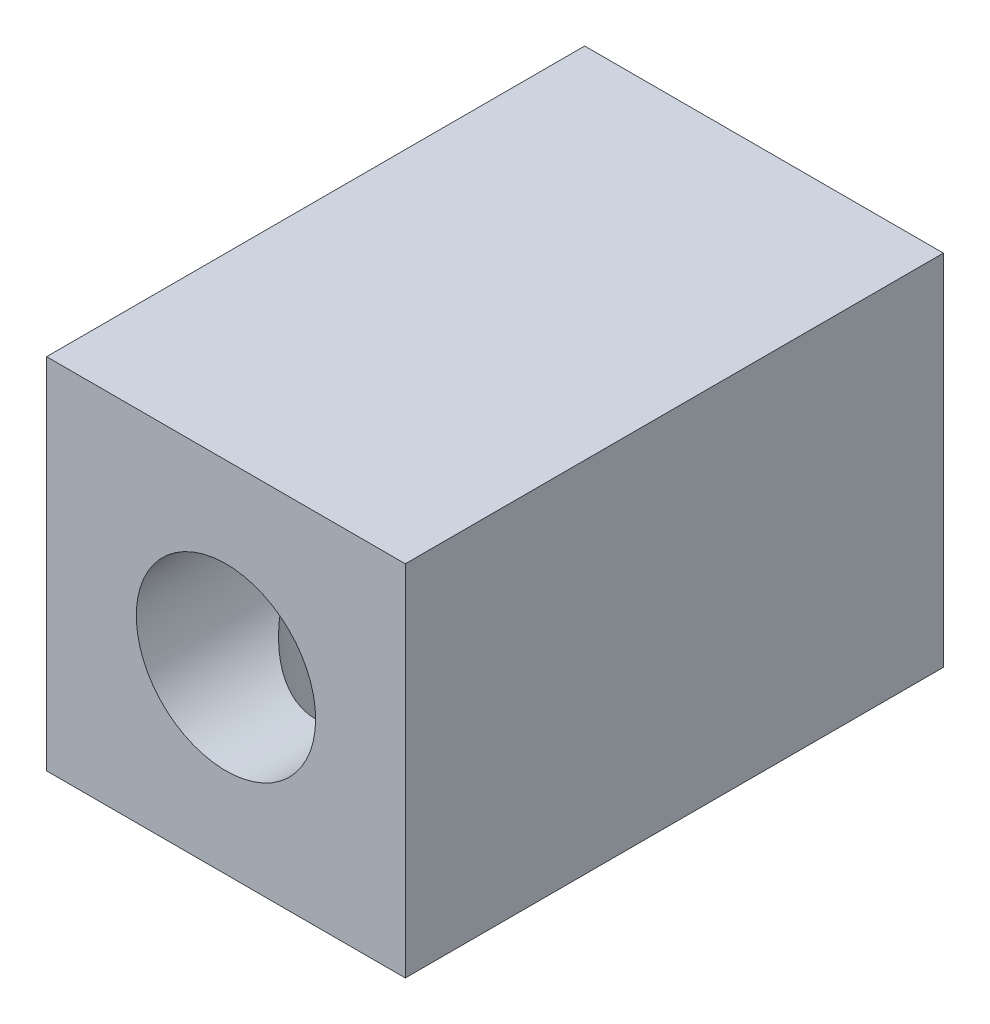
ISO-10303-21;
HEADER;
FILE_DESCRIPTION(('STEP AP214'),'2;1');
FILE_NAME('part.step','',(''),(''),'','','');
FILE_SCHEMA(('AUTOMOTIVE_DESIGN { 1 0 10303 214 1 1 1 1 }'));
ENDSEC;
DATA;
#1=APPLICATION_CONTEXT('core data for automotive mechanical design processes');
#2=APPLICATION_PROTOCOL_DEFINITION('international standard','automotive_design',2000,#1);
#3=PRODUCT_CONTEXT('',#1,'mechanical');
#4=PRODUCT('Part','Part','',(#3));
#5=PRODUCT_RELATED_PRODUCT_CATEGORY('part','',(#4));
#6=PRODUCT_DEFINITION_FORMATION('','',#4);
#7=PRODUCT_DEFINITION_CONTEXT('part definition',#1,'design');
#8=PRODUCT_DEFINITION('design','',#6,#7);
#9=PRODUCT_DEFINITION_SHAPE('','',#8);
#10=(LENGTH_UNIT() NAMED_UNIT(*) SI_UNIT(.MILLI.,.METRE.));
#11=(NAMED_UNIT(*) PLANE_ANGLE_UNIT() SI_UNIT($,.RADIAN.));
#12=(NAMED_UNIT(*) SI_UNIT($,.STERADIAN.) SOLID_ANGLE_UNIT());
#13=UNCERTAINTY_MEASURE_WITH_UNIT(LENGTH_MEASURE(1.E-05),#10,'distance_accuracy_value','');
#14=(GEOMETRIC_REPRESENTATION_CONTEXT(3) GLOBAL_UNCERTAINTY_ASSIGNED_CONTEXT((#13)) GLOBAL_UNIT_ASSIGNED_CONTEXT((#10,
#11,#12)) REPRESENTATION_CONTEXT('',''));
#15=CARTESIAN_POINT('',(0.,0.,0.));
#16=DIRECTION('',(0.,0.,1.));
#17=DIRECTION('',(1.,0.,0.));
#18=AXIS2_PLACEMENT_3D('',#15,#16,#17);
#19=CARTESIAN_POINT('',(-4.99999999999969,-5.00000000000075,15.0000000000006));
#20=DIRECTION('',(0.,0.,-1.));
#21=DIRECTION('',(-1.00000000000002,0.,0.));
#22=AXIS2_PLACEMENT_3D('',#19,#20,#21);
#23=PLANE('',#22);
#24=DIRECTION('',(0.,-1.00000000000001,0.));
#25=VECTOR('',#24,1.);
#26=CARTESIAN_POINT('',(-4.99999999999969,-5.00000000000075,15.0000000000006));
#27=LINE('',#26,#25);
#28=CARTESIAN_POINT('',(-5.00000000000001,4.99999999999923,14.9999999999993));
#29=VERTEX_POINT('',#28);
#30=CARTESIAN_POINT('',(-4.99999999999969,-5.00000000000075,15.0000000000006));
#31=VERTEX_POINT('',#30);
#32=EDGE_CURVE('E91',#29,#31,#27,.T.);
#33=ORIENTED_EDGE('',*,*,#32,.T.);
#34=DIRECTION('',(1.00000000000002,0.,0.));
#35=VECTOR('',#34,1.);
#36=CARTESIAN_POINT('',(-4.99999999999969,-5.00000000000075,15.0000000000006));
#37=LINE('',#36,#35);
#38=CARTESIAN_POINT('',(5.0000000000001,-5.00000000000084,15.0000000000014));
#39=VERTEX_POINT('',#38);
#40=EDGE_CURVE('E93',#31,#39,#37,.T.);
#41=ORIENTED_EDGE('',*,*,#40,.T.);
#42=DIRECTION('',(0.,1.00000000000001,0.));
#43=VECTOR('',#42,1.);
#44=CARTESIAN_POINT('',(5.0000000000001,-5.00000000000084,15.0000000000014));
#45=LINE('',#44,#43);
#46=CARTESIAN_POINT('',(5.0000000000003,4.99999999999892,15.0000000000009));
#47=VERTEX_POINT('',#46);
#48=EDGE_CURVE('E95',#39,#47,#45,.T.);
#49=ORIENTED_EDGE('',*,*,#48,.T.);
#50=DIRECTION('',(-1.00000000000002,0.,0.));
#51=VECTOR('',#50,1.);
#52=CARTESIAN_POINT('',(-5.00000000000001,4.99999999999923,14.9999999999993));
#53=LINE('',#52,#51);
#54=EDGE_CURVE('E36',#47,#29,#53,.T.);
#55=ORIENTED_EDGE('',*,*,#54,.T.);
#56=EDGE_LOOP('',(#33,#41,#49,#55));
#57=FACE_BOUND('',#56,.T.);
#58=CARTESIAN_POINT('',(0.,-1.33226762955019E-12,15.0000000000024));
#59=DIRECTION('',(0.,0.,1.));
#60=DIRECTION('',(1.00000000000002,0.,0.));
#61=AXIS2_PLACEMENT_3D('',#58,#59,#60);
#62=CIRCLE('',#61,2.5);
#63=CARTESIAN_POINT('',(2.50000000000007,-1.33253122620337E-12,15.0000000000024));
#64=VERTEX_POINT('',#63);
#65=EDGE_CURVE('E71',#64,#64,#62,.T.);
#66=ORIENTED_EDGE('',*,*,#65,.F.);
#67=EDGE_LOOP('',(#66));
#68=FACE_BOUND('',#67,.T.);
#69=ADVANCED_FACE('F16',(#57,#68),#23,.F.);
#70=CARTESIAN_POINT('',(-5.00000000000015,-5.00000000000064,1.25593979660721E-12));
#71=DIRECTION('',(0.,0.,-1.));
#72=DIRECTION('',(-1.00000000000002,0.,0.));
#73=AXIS2_PLACEMENT_3D('',#70,#71,#72);
#74=PLANE('',#73);
#75=DIRECTION('',(0.,-1.00000000000001,0.));
#76=VECTOR('',#75,1.);
#77=CARTESIAN_POINT('',(-5.00000000000015,-5.00000000000064,1.25593979660721E-12));
#78=LINE('',#77,#76);
#79=CARTESIAN_POINT('',(-4.99999999999864,5.00000000000117,1.63237479089418E-12));
#80=VERTEX_POINT('',#79);
#81=CARTESIAN_POINT('',(-5.00000000000015,-5.00000000000064,1.25593979660721E-12));
#82=VERTEX_POINT('',#81);
#83=EDGE_CURVE('E78',#80,#82,#78,.T.);
#84=ORIENTED_EDGE('',*,*,#83,.F.);
#85=DIRECTION('',(-1.00000000000002,0.,0.));
#86=VECTOR('',#85,1.);
#87=CARTESIAN_POINT('',(-4.99999999999864,5.00000000000117,1.63237479089418E-12));
#88=LINE('',#87,#86);
#89=CARTESIAN_POINT('',(4.99999999999969,4.99999999999889,2.00707506170517E-12));
#90=VERTEX_POINT('',#89);
#91=EDGE_CURVE('E89',#90,#80,#88,.T.);
#92=ORIENTED_EDGE('',*,*,#91,.F.);
#93=DIRECTION('',(0.,1.00000000000001,0.));
#94=VECTOR('',#93,1.);
#95=CARTESIAN_POINT('',(4.99999999999946,-5.00000000000123,1.95329863394988E-12));
#96=LINE('',#95,#94);
#97=CARTESIAN_POINT('',(4.99999999999946,-5.00000000000123,1.95329863394988E-12));
#98=VERTEX_POINT('',#97);
#99=EDGE_CURVE('E87',#98,#90,#96,.T.);
#100=ORIENTED_EDGE('',*,*,#99,.F.);
#101=DIRECTION('',(1.00000000000002,0.,0.));
#102=VECTOR('',#101,1.);
#103=CARTESIAN_POINT('',(-5.00000000000015,-5.00000000000064,1.25593979660721E-12));
#104=LINE('',#103,#102);
#105=EDGE_CURVE('E85',#82,#98,#104,.T.);
#106=ORIENTED_EDGE('',*,*,#105,.F.);
#107=EDGE_LOOP('',(#84,#92,#100,#106));
#108=FACE_BOUND('',#107,.T.);
#109=CARTESIAN_POINT('',(-4.71844785465692E-13,-2.22044604925031E-13,5.42968447980741E-13));
#110=DIRECTION('',(0.,0.,1.));
#111=DIRECTION('',(1.00000000000002,0.,0.));
#112=AXIS2_PLACEMENT_3D('',#109,#110,#111);
#113=CIRCLE('',#112,2.5);
#114=CARTESIAN_POINT('',(2.49999999999957,-2.22308201578217E-13,5.39542369115686E-13));
#115=VERTEX_POINT('',#114);
#116=EDGE_CURVE('E74',#115,#115,#113,.T.);
#117=ORIENTED_EDGE('',*,*,#116,.T.);
#118=EDGE_LOOP('',(#117));
#119=FACE_BOUND('',#118,.T.);
#120=ADVANCED_FACE('F117',(#108,#119),#74,.T.);
#121=CARTESIAN_POINT('',(-4.99999999999969,-5.00000000000075,15.0000000000006));
#122=DIRECTION('',(1.00000000000002,0.,0.));
#123=DIRECTION('',(0.,0.,-1.));
#124=AXIS2_PLACEMENT_3D('',#121,#122,#123);
#125=PLANE('',#124);
#126=ORIENTED_EDGE('',*,*,#83,.T.);
#127=DIRECTION('',(0.,0.,-1.));
#128=VECTOR('',#127,1.);
#129=CARTESIAN_POINT('',(-4.99999999999969,-5.00000000000075,15.0000000000006));
#130=LINE('',#129,#128);
#131=EDGE_CURVE('E62',#31,#82,#130,.T.);
#132=ORIENTED_EDGE('',*,*,#131,.F.);
#133=ORIENTED_EDGE('',*,*,#32,.F.);
#134=DIRECTION('',(0.,0.,-1.));
#135=VECTOR('',#134,1.);
#136=CARTESIAN_POINT('',(-5.00000000000001,4.99999999999923,14.9999999999993));
#137=LINE('',#136,#135);
#138=EDGE_CURVE('E98',#29,#80,#137,.T.);
#139=ORIENTED_EDGE('',*,*,#138,.T.);
#140=EDGE_LOOP('',(#126,#132,#133,#139));
#141=FACE_BOUND('',#140,.T.);
#142=ADVANCED_FACE('F18',(#141),#125,.F.);
#143=CARTESIAN_POINT('',(-4.99999999999969,-5.00000000000075,15.0000000000006));
#144=DIRECTION('',(0.,1.00000000000001,0.));
#145=DIRECTION('',(0.,0.,1.));
#146=AXIS2_PLACEMENT_3D('',#143,#144,#145);
#147=PLANE('',#146);
#148=CARTESIAN_POINT('',(0.,-5.00000000000039,10.0000000000004));
#149=DIRECTION('',(0.,1.00000000000001,0.));
#150=DIRECTION('',(0.,0.,1.));
#151=AXIS2_PLACEMENT_3D('',#148,#149,#150);
#152=CIRCLE('',#151,2.5);
#153=CARTESIAN_POINT('',(0.,-5.00000000000033,12.5000000000004));
#154=VERTEX_POINT('',#153);
#155=EDGE_CURVE('E76',#154,#154,#152,.T.);
#156=ORIENTED_EDGE('',*,*,#155,.T.);
#157=EDGE_LOOP('',(#156));
#158=FACE_BOUND('',#157,.T.);
#159=ORIENTED_EDGE('',*,*,#105,.T.);
#160=DIRECTION('',(0.,0.,-1.));
#161=VECTOR('',#160,1.);
#162=CARTESIAN_POINT('',(5.0000000000001,-5.00000000000084,15.0000000000014));
#163=LINE('',#162,#161);
#164=EDGE_CURVE('E104',#39,#98,#163,.T.);
#165=ORIENTED_EDGE('',*,*,#164,.F.);
#166=ORIENTED_EDGE('',*,*,#40,.F.);
#167=ORIENTED_EDGE('',*,*,#131,.T.);
#168=EDGE_LOOP('',(#159,#165,#166,#167));
#169=FACE_BOUND('',#168,.T.);
#170=ADVANCED_FACE('F110',(#158,#169),#147,.F.);
#171=CARTESIAN_POINT('',(5.0000000000001,-5.00000000000084,15.0000000000014));
#172=DIRECTION('',(-1.00000000000002,0.,0.));
#173=DIRECTION('',(0.,0.,1.));
#174=AXIS2_PLACEMENT_3D('',#171,#172,#173);
#175=PLANE('',#174);
#176=ORIENTED_EDGE('',*,*,#99,.T.);
#177=DIRECTION('',(0.,0.,-1.));
#178=VECTOR('',#177,1.);
#179=CARTESIAN_POINT('',(5.0000000000003,4.99999999999892,15.0000000000009));
#180=LINE('',#179,#178);
#181=EDGE_CURVE('E101',#47,#90,#180,.T.);
#182=ORIENTED_EDGE('',*,*,#181,.F.);
#183=ORIENTED_EDGE('',*,*,#48,.F.);
#184=ORIENTED_EDGE('',*,*,#164,.T.);
#185=EDGE_LOOP('',(#176,#182,#183,#184));
#186=FACE_BOUND('',#185,.T.);
#187=ADVANCED_FACE('F121',(#186),#175,.F.);
#188=CARTESIAN_POINT('',(-5.00000000000001,4.99999999999923,14.9999999999993));
#189=DIRECTION('',(0.,-1.00000000000001,0.));
#190=DIRECTION('',(1.00000000000002,0.,0.));
#191=AXIS2_PLACEMENT_3D('',#188,#189,#190);
#192=PLANE('',#191);
#193=ORIENTED_EDGE('',*,*,#91,.T.);
#194=ORIENTED_EDGE('',*,*,#138,.F.);
#195=ORIENTED_EDGE('',*,*,#54,.F.);
#196=ORIENTED_EDGE('',*,*,#181,.T.);
#197=EDGE_LOOP('',(#193,#194,#195,#196));
#198=FACE_BOUND('',#197,.T.);
#199=ADVANCED_FACE('F66',(#198),#192,.F.);
#200=CARTESIAN_POINT('',(0.,-1.33226762955019E-12,15.0000000000024));
#201=DIRECTION('',(0.,0.,-1.));
#202=DIRECTION('',(-1.00000000000002,0.,0.));
#203=AXIS2_PLACEMENT_3D('',#200,#201,#202);
#204=CYLINDRICAL_SURFACE('',#203,2.5);
#205=CARTESIAN_POINT('',(-2.28983498828939E-13,1.2490009027033E-12,10.0000000000006));
#206=DIRECTION('',(0.,0.707106781186553,-0.707106781186543));
#207=DIRECTION('',(0.,-0.70710678118658,-0.70710678118658));
#208=AXIS2_PLACEMENT_3D('',#205,#206,#207);
#209=ELLIPSE('',#208,3.53553390593274,2.5);
#210=CARTESIAN_POINT('',(2.50000000000033,0.,9.99999999999763));
#211=VERTEX_POINT('',#210);
#212=CARTESIAN_POINT('',(-2.5000000000007,1.22124532708767E-12,9.99999999999995));
#213=VERTEX_POINT('',#212);
#214=EDGE_CURVE('E11',#211,#213,#209,.T.);
#215=ORIENTED_EDGE('',*,*,#214,.F.);
#216=CARTESIAN_POINT('',(-2.28983498828939E-13,1.2490009027033E-12,10.0000000000006));
#217=DIRECTION('',(0.,-0.70710678118658,-0.70710678118658));
#218=DIRECTION('',(0.,0.707106781186553,-0.707106781186543));
#219=AXIS2_PLACEMENT_3D('',#216,#217,#218);
#220=ELLIPSE('',#219,3.53553390593274,2.5);
#221=EDGE_CURVE('E24',#213,#211,#220,.F.);
#222=ORIENTED_EDGE('',*,*,#221,.F.);
#223=EDGE_LOOP('',(#215,#222));
#224=FACE_BOUND('',#223,.T.);
#225=ORIENTED_EDGE('',*,*,#65,.T.);
#226=EDGE_LOOP('',(#225));
#227=FACE_BOUND('',#226,.T.);
#228=ORIENTED_EDGE('',*,*,#116,.F.);
#229=EDGE_LOOP('',(#228));
#230=FACE_BOUND('',#229,.T.);
#231=ADVANCED_FACE('F63',(#224,#227,#230),#204,.F.);
#232=CARTESIAN_POINT('',(0.,-5.00000000000039,10.0000000000004));
#233=DIRECTION('',(0.,1.00000000000001,0.));
#234=DIRECTION('',(0.,0.,1.));
#235=AXIS2_PLACEMENT_3D('',#232,#233,#234);
#236=CYLINDRICAL_SURFACE('',#235,2.5);
#237=ORIENTED_EDGE('',*,*,#214,.T.);
#238=ORIENTED_EDGE('',*,*,#221,.T.);
#239=EDGE_LOOP('',(#237,#238));
#240=FACE_BOUND('',#239,.T.);
#241=ORIENTED_EDGE('',*,*,#155,.F.);
#242=EDGE_LOOP('',(#241));
#243=FACE_BOUND('',#242,.T.);
#244=ADVANCED_FACE('F59',(#240,#243),#236,.F.);
#245=CLOSED_SHELL('',(#69,#120,#142,#170,#187,#199,#231,#244));
#246=MANIFOLD_SOLID_BREP('B1',#245);
#247=ADVANCED_BREP_SHAPE_REPRESENTATION('',(#18,#246),#14);
#248=SHAPE_DEFINITION_REPRESENTATION(#9,#247);
ENDSEC;
END-ISO-10303-21;
